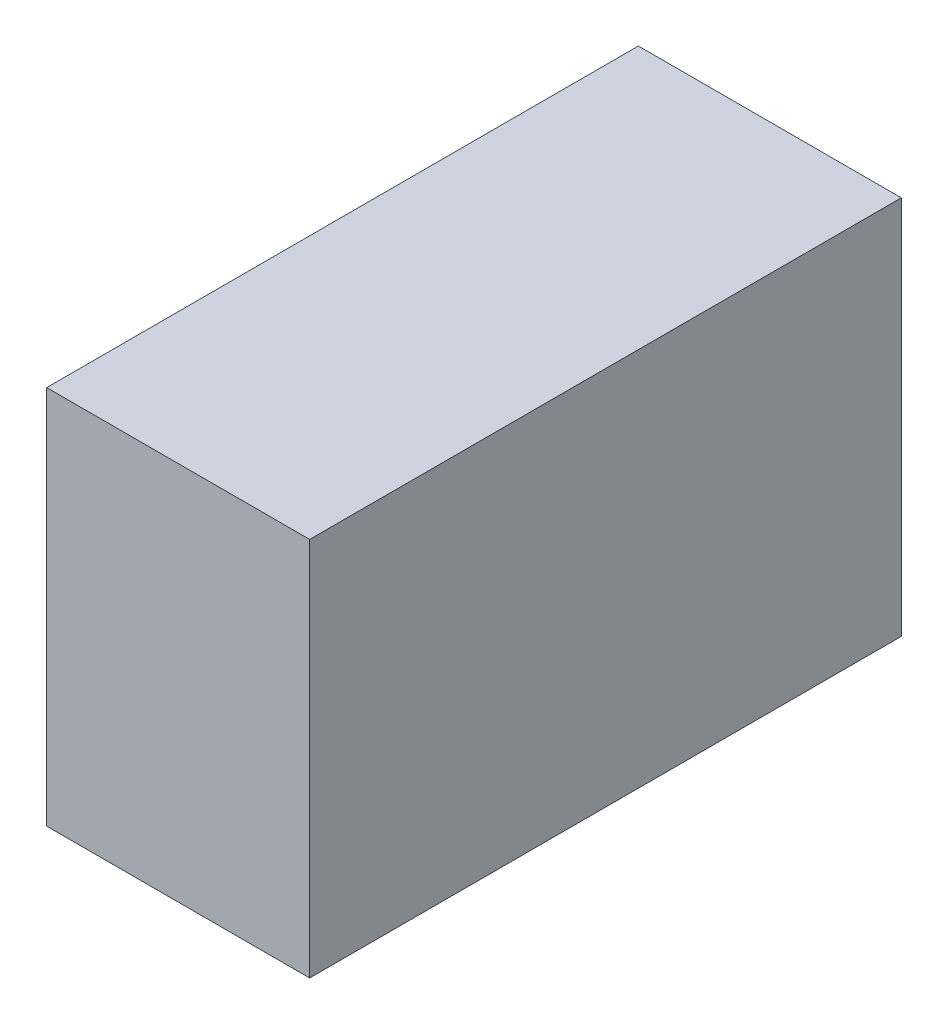
ISO-10303-21;
HEADER;
FILE_DESCRIPTION(('STEP AP214'),'2;1');
FILE_NAME('part.step','',(''),(''),'','','');
FILE_SCHEMA(('AUTOMOTIVE_DESIGN { 1 0 10303 214 1 1 1 1 }'));
ENDSEC;
DATA;
#1=APPLICATION_CONTEXT('core data for automotive mechanical design processes');
#2=APPLICATION_PROTOCOL_DEFINITION('international standard','automotive_design',2000,#1);
#3=PRODUCT_CONTEXT('',#1,'mechanical');
#4=PRODUCT('Part','Part','',(#3));
#5=PRODUCT_RELATED_PRODUCT_CATEGORY('part','',(#4));
#6=PRODUCT_DEFINITION_FORMATION('','',#4);
#7=PRODUCT_DEFINITION_CONTEXT('part definition',#1,'design');
#8=PRODUCT_DEFINITION('design','',#6,#7);
#9=PRODUCT_DEFINITION_SHAPE('','',#8);
#10=(LENGTH_UNIT() NAMED_UNIT(*) SI_UNIT(.MILLI.,.METRE.));
#11=(NAMED_UNIT(*) PLANE_ANGLE_UNIT() SI_UNIT($,.RADIAN.));
#12=(NAMED_UNIT(*) SI_UNIT($,.STERADIAN.) SOLID_ANGLE_UNIT());
#13=UNCERTAINTY_MEASURE_WITH_UNIT(LENGTH_MEASURE(1.E-05),#10,'distance_accuracy_value','');
#14=(GEOMETRIC_REPRESENTATION_CONTEXT(3) GLOBAL_UNCERTAINTY_ASSIGNED_CONTEXT((#13)) GLOBAL_UNIT_ASSIGNED_CONTEXT((#10,
#11,#12)) REPRESENTATION_CONTEXT('',''));
#15=CARTESIAN_POINT('',(0.,0.,0.));
#16=DIRECTION('',(0.,0.,1.));
#17=DIRECTION('',(1.,0.,0.));
#18=AXIS2_PLACEMENT_3D('',#15,#16,#17);
#19=CARTESIAN_POINT('',(0.,0.,57.15));
#20=DIRECTION('',(1.,0.,0.));
#21=DIRECTION('',(0.,0.,-1.));
#22=AXIS2_PLACEMENT_3D('',#19,#20,#21);
#23=PLANE('',#22);
#24=DIRECTION('',(0.,-1.,0.));
#25=VECTOR('',#24,1.);
#26=CARTESIAN_POINT('',(0.,0.,0.));
#27=LINE('',#26,#25);
#28=CARTESIAN_POINT('',(0.,36.68776,0.));
#29=VERTEX_POINT('',#28);
#30=CARTESIAN_POINT('',(0.,0.,0.));
#31=VERTEX_POINT('',#30);
#32=EDGE_CURVE('E102',#29,#31,#27,.T.);
#33=ORIENTED_EDGE('',*,*,#32,.T.);
#34=DIRECTION('',(0.,0.,-1.));
#35=VECTOR('',#34,1.);
#36=CARTESIAN_POINT('',(0.,0.,57.15));
#37=LINE('',#36,#35);
#38=CARTESIAN_POINT('',(0.,0.,57.15));
#39=VERTEX_POINT('',#38);
#40=EDGE_CURVE('E11',#39,#31,#37,.T.);
#41=ORIENTED_EDGE('',*,*,#40,.F.);
#42=DIRECTION('',(0.,-1.,0.));
#43=VECTOR('',#42,1.);
#44=CARTESIAN_POINT('',(0.,0.,57.15));
#45=LINE('',#44,#43);
#46=CARTESIAN_POINT('',(0.,36.68776,57.15));
#47=VERTEX_POINT('',#46);
#48=EDGE_CURVE('E90',#47,#39,#45,.T.);
#49=ORIENTED_EDGE('',*,*,#48,.F.);
#50=DIRECTION('',(0.,0.,-1.));
#51=VECTOR('',#50,1.);
#52=CARTESIAN_POINT('',(0.,36.68776,57.15));
#53=LINE('',#52,#51);
#54=EDGE_CURVE('E98',#47,#29,#53,.T.);
#55=ORIENTED_EDGE('',*,*,#54,.T.);
#56=EDGE_LOOP('',(#33,#41,#49,#55));
#57=FACE_BOUND('',#56,.T.);
#58=ADVANCED_FACE('F39',(#57),#23,.F.);
#59=CARTESIAN_POINT('',(0.,0.,57.15));
#60=DIRECTION('',(0.,1.,0.));
#61=DIRECTION('',(0.,0.,1.));
#62=AXIS2_PLACEMENT_3D('',#59,#60,#61);
#63=PLANE('',#62);
#64=DIRECTION('',(1.,0.,0.));
#65=VECTOR('',#64,1.);
#66=CARTESIAN_POINT('',(0.,0.,0.));
#67=LINE('',#66,#65);
#68=CARTESIAN_POINT('',(25.4,0.,0.));
#69=VERTEX_POINT('',#68);
#70=EDGE_CURVE('E94',#31,#69,#67,.T.);
#71=ORIENTED_EDGE('',*,*,#70,.T.);
#72=DIRECTION('',(0.,0.,-1.));
#73=VECTOR('',#72,1.);
#74=CARTESIAN_POINT('',(25.4,0.,57.15));
#75=LINE('',#74,#73);
#76=CARTESIAN_POINT('',(25.4,0.,57.15));
#77=VERTEX_POINT('',#76);
#78=EDGE_CURVE('E47',#77,#69,#75,.T.);
#79=ORIENTED_EDGE('',*,*,#78,.F.);
#80=DIRECTION('',(1.,0.,0.));
#81=VECTOR('',#80,1.);
#82=CARTESIAN_POINT('',(0.,0.,57.15));
#83=LINE('',#82,#81);
#84=EDGE_CURVE('E85',#39,#77,#83,.T.);
#85=ORIENTED_EDGE('',*,*,#84,.F.);
#86=ORIENTED_EDGE('',*,*,#40,.T.);
#87=EDGE_LOOP('',(#71,#79,#85,#86));
#88=FACE_BOUND('',#87,.T.);
#89=ADVANCED_FACE('F93',(#88),#63,.F.);
#90=CARTESIAN_POINT('',(25.4,0.,57.15));
#91=DIRECTION('',(-1.,0.,0.));
#92=DIRECTION('',(0.,0.,1.));
#93=AXIS2_PLACEMENT_3D('',#90,#91,#92);
#94=PLANE('',#93);
#95=DIRECTION('',(0.,1.,0.));
#96=VECTOR('',#95,1.);
#97=CARTESIAN_POINT('',(25.4,0.,0.));
#98=LINE('',#97,#96);
#99=CARTESIAN_POINT('',(25.4,36.68776,0.));
#100=VERTEX_POINT('',#99);
#101=EDGE_CURVE('E72',#69,#100,#98,.T.);
#102=ORIENTED_EDGE('',*,*,#101,.T.);
#103=DIRECTION('',(0.,0.,-1.));
#104=VECTOR('',#103,1.);
#105=CARTESIAN_POINT('',(25.4,36.68776,57.15));
#106=LINE('',#105,#104);
#107=CARTESIAN_POINT('',(25.4,36.68776,57.15));
#108=VERTEX_POINT('',#107);
#109=EDGE_CURVE('E95',#108,#100,#106,.T.);
#110=ORIENTED_EDGE('',*,*,#109,.F.);
#111=DIRECTION('',(0.,1.,0.));
#112=VECTOR('',#111,1.);
#113=CARTESIAN_POINT('',(25.4,0.,57.15));
#114=LINE('',#113,#112);
#115=EDGE_CURVE('E88',#77,#108,#114,.T.);
#116=ORIENTED_EDGE('',*,*,#115,.F.);
#117=ORIENTED_EDGE('',*,*,#78,.T.);
#118=EDGE_LOOP('',(#102,#110,#116,#117));
#119=FACE_BOUND('',#118,.T.);
#120=ADVANCED_FACE('F96',(#119),#94,.F.);
#121=CARTESIAN_POINT('',(0.,36.68776,57.15));
#122=DIRECTION('',(0.,-1.,0.));
#123=DIRECTION('',(0.,0.,-1.));
#124=AXIS2_PLACEMENT_3D('',#121,#122,#123);
#125=PLANE('',#124);
#126=DIRECTION('',(-1.,0.,0.));
#127=VECTOR('',#126,1.);
#128=CARTESIAN_POINT('',(0.,36.68776,0.));
#129=LINE('',#128,#127);
#130=EDGE_CURVE('E78',#100,#29,#129,.T.);
#131=ORIENTED_EDGE('',*,*,#130,.T.);
#132=ORIENTED_EDGE('',*,*,#54,.F.);
#133=DIRECTION('',(-1.,0.,0.));
#134=VECTOR('',#133,1.);
#135=CARTESIAN_POINT('',(0.,36.68776,57.15));
#136=LINE('',#135,#134);
#137=EDGE_CURVE('E55',#108,#47,#136,.T.);
#138=ORIENTED_EDGE('',*,*,#137,.F.);
#139=ORIENTED_EDGE('',*,*,#109,.T.);
#140=EDGE_LOOP('',(#131,#132,#138,#139));
#141=FACE_BOUND('',#140,.T.);
#142=ADVANCED_FACE('F109',(#141),#125,.F.);
#143=CARTESIAN_POINT('',(0.,0.,57.15));
#144=DIRECTION('',(0.,0.,-1.));
#145=DIRECTION('',(-1.,0.,0.));
#146=AXIS2_PLACEMENT_3D('',#143,#144,#145);
#147=PLANE('',#146);
#148=ORIENTED_EDGE('',*,*,#48,.T.);
#149=ORIENTED_EDGE('',*,*,#84,.T.);
#150=ORIENTED_EDGE('',*,*,#115,.T.);
#151=ORIENTED_EDGE('',*,*,#137,.T.);
#152=EDGE_LOOP('',(#148,#149,#150,#151));
#153=FACE_BOUND('',#152,.T.);
#154=ADVANCED_FACE('F86',(#153),#147,.F.);
#155=CARTESIAN_POINT('',(0.,0.,0.));
#156=DIRECTION('',(0.,0.,-1.));
#157=DIRECTION('',(-1.,0.,0.));
#158=AXIS2_PLACEMENT_3D('',#155,#156,#157);
#159=PLANE('',#158);
#160=ORIENTED_EDGE('',*,*,#32,.F.);
#161=ORIENTED_EDGE('',*,*,#130,.F.);
#162=ORIENTED_EDGE('',*,*,#101,.F.);
#163=ORIENTED_EDGE('',*,*,#70,.F.);
#164=EDGE_LOOP('',(#160,#161,#162,#163));
#165=FACE_BOUND('',#164,.T.);
#166=ADVANCED_FACE('F112',(#165),#159,.T.);
#167=CLOSED_SHELL('',(#58,#89,#120,#142,#154,#166));
#168=MANIFOLD_SOLID_BREP('B2',#167);
#169=ADVANCED_BREP_SHAPE_REPRESENTATION('',(#18,#168),#14);
#170=SHAPE_DEFINITION_REPRESENTATION(#9,#169);
ENDSEC;
END-ISO-10303-21;
